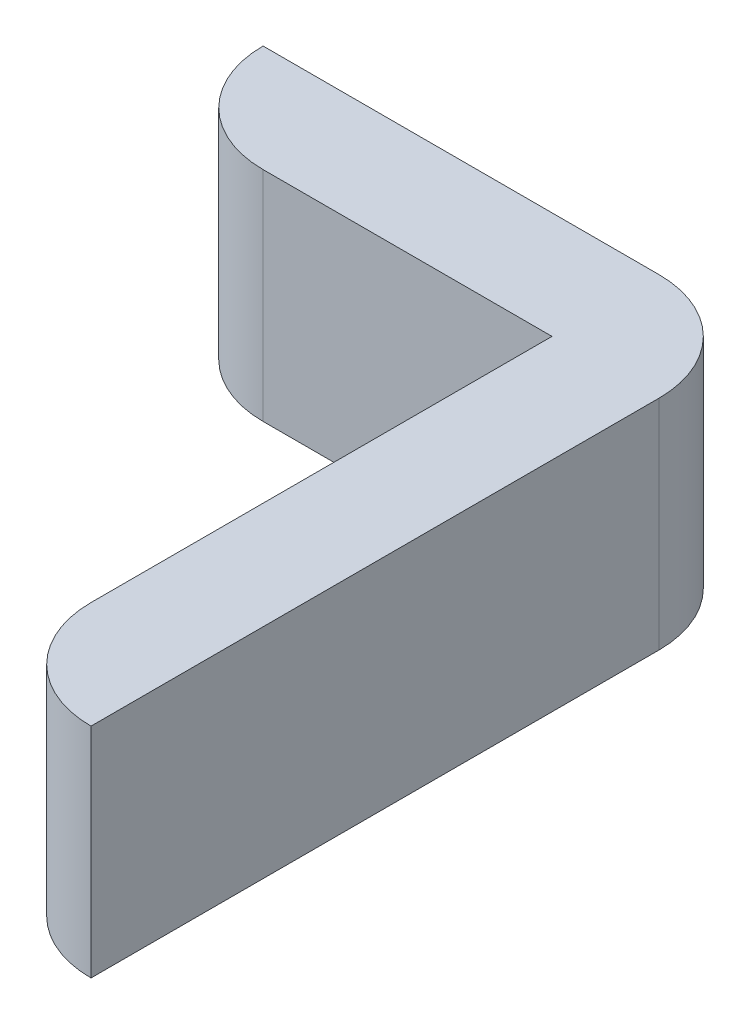
ISO-10303-21;
HEADER;
FILE_DESCRIPTION(('STEP AP214'),'2;1');
FILE_NAME('part.step','',(''),(''),'','','');
FILE_SCHEMA(('AUTOMOTIVE_DESIGN { 1 0 10303 214 1 1 1 1 }'));
ENDSEC;
DATA;
#1=APPLICATION_CONTEXT('core data for automotive mechanical design processes');
#2=APPLICATION_PROTOCOL_DEFINITION('international standard','automotive_design',2000,#1);
#3=PRODUCT_CONTEXT('',#1,'mechanical');
#4=PRODUCT('Part','Part','',(#3));
#5=PRODUCT_RELATED_PRODUCT_CATEGORY('part','',(#4));
#6=PRODUCT_DEFINITION_FORMATION('','',#4);
#7=PRODUCT_DEFINITION_CONTEXT('part definition',#1,'design');
#8=PRODUCT_DEFINITION('design','',#6,#7);
#9=PRODUCT_DEFINITION_SHAPE('','',#8);
#10=(LENGTH_UNIT() NAMED_UNIT(*) SI_UNIT(.MILLI.,.METRE.));
#11=(NAMED_UNIT(*) PLANE_ANGLE_UNIT() SI_UNIT($,.RADIAN.));
#12=(NAMED_UNIT(*) SI_UNIT($,.STERADIAN.) SOLID_ANGLE_UNIT());
#13=UNCERTAINTY_MEASURE_WITH_UNIT(LENGTH_MEASURE(1.E-05),#10,'distance_accuracy_value','');
#14=(GEOMETRIC_REPRESENTATION_CONTEXT(3) GLOBAL_UNCERTAINTY_ASSIGNED_CONTEXT((#13)) GLOBAL_UNIT_ASSIGNED_CONTEXT((#10,
#11,#12)) REPRESENTATION_CONTEXT('',''));
#15=CARTESIAN_POINT('',(0.,0.,0.));
#16=DIRECTION('',(0.,0.,1.));
#17=DIRECTION('',(1.,0.,0.));
#18=AXIS2_PLACEMENT_3D('',#15,#16,#17);
#19=CARTESIAN_POINT('',(9.275,-4.8252,0.));
#20=DIRECTION('',(0.,-1.,0.));
#21=DIRECTION('',(0.,0.,-1.));
#22=AXIS2_PLACEMENT_3D('',#19,#20,#21);
#23=PLANE('',#22);
#24=DIRECTION('',(-1.,0.,0.));
#25=VECTOR('',#24,1.);
#26=CARTESIAN_POINT('',(9.525,-4.8252,0.25));
#27=LINE('',#26,#25);
#28=CARTESIAN_POINT('',(9.525,-4.8252,0.25));
#29=VERTEX_POINT('',#28);
#30=CARTESIAN_POINT('',(10.2,-4.8252,0.25));
#31=VERTEX_POINT('',#30);
#32=EDGE_CURVE('E102',#29,#31,#27,.F.);
#33=ORIENTED_EDGE('',*,*,#32,.T.);
#34=DIRECTION('',(0.,0.,-1.));
#35=VECTOR('',#34,1.);
#36=CARTESIAN_POINT('',(10.2,-4.8252,0.25));
#37=LINE('',#36,#35);
#38=CARTESIAN_POINT('',(10.2,-4.8252,1.327));
#39=VERTEX_POINT('',#38);
#40=EDGE_CURVE('E108',#31,#39,#37,.F.);
#41=ORIENTED_EDGE('',*,*,#40,.T.);
#42=CARTESIAN_POINT('',(10.45,-4.8252,1.327));
#43=DIRECTION('',(0.,-1.,0.));
#44=DIRECTION('',(0.,0.,-1.));
#45=AXIS2_PLACEMENT_3D('',#42,#43,#44);
#46=CIRCLE('',#45,0.25);
#47=CARTESIAN_POINT('',(10.45,-4.8252,1.577));
#48=VERTEX_POINT('',#47);
#49=EDGE_CURVE('E80',#48,#39,#46,.T.);
#50=ORIENTED_EDGE('',*,*,#49,.F.);
#51=DIRECTION('',(0.,0.,1.));
#52=VECTOR('',#51,1.);
#53=CARTESIAN_POINT('',(10.45,-4.8252,1.577));
#54=LINE('',#53,#52);
#55=CARTESIAN_POINT('',(10.45,-4.8252,0.25));
#56=VERTEX_POINT('',#55);
#57=EDGE_CURVE('E75',#48,#56,#54,.F.);
#58=ORIENTED_EDGE('',*,*,#57,.T.);
#59=CARTESIAN_POINT('',(10.2,-4.8252,0.25));
#60=DIRECTION('',(0.,-1.,0.));
#61=DIRECTION('',(0.,0.,-1.));
#62=AXIS2_PLACEMENT_3D('',#59,#60,#61);
#63=CIRCLE('',#62,0.25);
#64=CARTESIAN_POINT('',(10.2,-4.8252,0.));
#65=VERTEX_POINT('',#64);
#66=EDGE_CURVE('E19',#65,#56,#63,.T.);
#67=ORIENTED_EDGE('',*,*,#66,.F.);
#68=DIRECTION('',(1.,0.,0.));
#69=VECTOR('',#68,1.);
#70=CARTESIAN_POINT('',(10.2,-4.8252,0.));
#71=LINE('',#70,#69);
#72=CARTESIAN_POINT('',(9.275,-4.8252,0.));
#73=VERTEX_POINT('',#72);
#74=EDGE_CURVE('E70',#65,#73,#71,.F.);
#75=ORIENTED_EDGE('',*,*,#74,.T.);
#76=CARTESIAN_POINT('',(9.525,-4.8252,0.));
#77=DIRECTION('',(0.,-1.,0.));
#78=DIRECTION('',(0.,0.,-1.));
#79=AXIS2_PLACEMENT_3D('',#76,#77,#78);
#80=CIRCLE('',#79,0.25);
#81=EDGE_CURVE('E121',#29,#73,#80,.T.);
#82=ORIENTED_EDGE('',*,*,#81,.F.);
#83=EDGE_LOOP('',(#33,#41,#50,#58,#67,#75,#82));
#84=FACE_BOUND('',#83,.T.);
#85=ADVANCED_FACE('F16',(#84),#23,.F.);
#86=CARTESIAN_POINT('',(10.2,-5.3348,0.));
#87=DIRECTION('',(0.,0.,1.));
#88=DIRECTION('',(1.,0.,0.));
#89=AXIS2_PLACEMENT_3D('',#86,#87,#88);
#90=PLANE('',#89);
#91=DIRECTION('',(0.,-1.,0.));
#92=VECTOR('',#91,1.);
#93=CARTESIAN_POINT('',(9.275,-5.3348,0.));
#94=LINE('',#93,#92);
#95=CARTESIAN_POINT('',(9.275,-5.3348,0.));
#96=VERTEX_POINT('',#95);
#97=EDGE_CURVE('E123',#73,#96,#94,.T.);
#98=ORIENTED_EDGE('',*,*,#97,.F.);
#99=ORIENTED_EDGE('',*,*,#74,.F.);
#100=DIRECTION('',(0.,-1.,0.));
#101=VECTOR('',#100,1.);
#102=CARTESIAN_POINT('',(10.2,-5.3348,0.));
#103=LINE('',#102,#101);
#104=CARTESIAN_POINT('',(10.2,-5.3348,0.));
#105=VERTEX_POINT('',#104);
#106=EDGE_CURVE('E92',#105,#65,#103,.F.);
#107=ORIENTED_EDGE('',*,*,#106,.F.);
#108=DIRECTION('',(1.,0.,0.));
#109=VECTOR('',#108,1.);
#110=CARTESIAN_POINT('',(9.275,-5.3348,0.));
#111=LINE('',#110,#109);
#112=EDGE_CURVE('E120',#96,#105,#111,.T.);
#113=ORIENTED_EDGE('',*,*,#112,.F.);
#114=EDGE_LOOP('',(#98,#99,#107,#113));
#115=FACE_BOUND('',#114,.T.);
#116=ADVANCED_FACE('F158',(#115),#90,.F.);
#117=CARTESIAN_POINT('',(10.2,-5.3348,0.25));
#118=DIRECTION('',(0.,-1.,0.));
#119=DIRECTION('',(0.,0.,-1.));
#120=AXIS2_PLACEMENT_3D('',#117,#118,#119);
#121=CYLINDRICAL_SURFACE('',#120,0.25);
#122=ORIENTED_EDGE('',*,*,#66,.T.);
#123=DIRECTION('',(0.,1.,0.));
#124=VECTOR('',#123,1.);
#125=CARTESIAN_POINT('',(10.45,-5.3348,0.25));
#126=LINE('',#125,#124);
#127=CARTESIAN_POINT('',(10.45,-5.3348,0.25));
#128=VERTEX_POINT('',#127);
#129=EDGE_CURVE('E86',#56,#128,#126,.F.);
#130=ORIENTED_EDGE('',*,*,#129,.T.);
#131=CARTESIAN_POINT('',(10.2,-5.3348,0.25));
#132=DIRECTION('',(0.,-1.,0.));
#133=DIRECTION('',(0.,0.,-1.));
#134=AXIS2_PLACEMENT_3D('',#131,#132,#133);
#135=CIRCLE('',#134,0.25);
#136=EDGE_CURVE('E118',#105,#128,#135,.T.);
#137=ORIENTED_EDGE('',*,*,#136,.F.);
#138=ORIENTED_EDGE('',*,*,#106,.T.);
#139=EDGE_LOOP('',(#122,#130,#137,#138));
#140=FACE_BOUND('',#139,.T.);
#141=ADVANCED_FACE('F89',(#140),#121,.T.);
#142=CARTESIAN_POINT('',(10.45,-5.3348,1.577));
#143=DIRECTION('',(-1.,0.,0.));
#144=DIRECTION('',(0.,0.,1.));
#145=AXIS2_PLACEMENT_3D('',#142,#143,#144);
#146=PLANE('',#145);
#147=DIRECTION('',(0.,-1.,0.));
#148=VECTOR('',#147,1.);
#149=CARTESIAN_POINT('',(10.45,-5.3348,1.577));
#150=LINE('',#149,#148);
#151=CARTESIAN_POINT('',(10.45,-5.3348,1.577));
#152=VERTEX_POINT('',#151);
#153=EDGE_CURVE('E85',#152,#48,#150,.F.);
#154=ORIENTED_EDGE('',*,*,#153,.F.);
#155=DIRECTION('',(0.,0.,-1.));
#156=VECTOR('',#155,1.);
#157=CARTESIAN_POINT('',(10.45,-5.3348,0.));
#158=LINE('',#157,#156);
#159=EDGE_CURVE('E94',#128,#152,#158,.F.);
#160=ORIENTED_EDGE('',*,*,#159,.F.);
#161=ORIENTED_EDGE('',*,*,#129,.F.);
#162=ORIENTED_EDGE('',*,*,#57,.F.);
#163=EDGE_LOOP('',(#154,#160,#161,#162));
#164=FACE_BOUND('',#163,.T.);
#165=ADVANCED_FACE('F93',(#164),#146,.F.);
#166=CARTESIAN_POINT('',(10.45,-5.3348,1.327));
#167=DIRECTION('',(0.,-1.,0.));
#168=DIRECTION('',(0.,0.,-1.));
#169=AXIS2_PLACEMENT_3D('',#166,#167,#168);
#170=CYLINDRICAL_SURFACE('',#169,0.25);
#171=ORIENTED_EDGE('',*,*,#49,.T.);
#172=DIRECTION('',(0.,1.,0.));
#173=VECTOR('',#172,1.);
#174=CARTESIAN_POINT('',(10.2,-5.3348,1.327));
#175=LINE('',#174,#173);
#176=CARTESIAN_POINT('',(10.2,-5.3348,1.327));
#177=VERTEX_POINT('',#176);
#178=EDGE_CURVE('E105',#39,#177,#175,.F.);
#179=ORIENTED_EDGE('',*,*,#178,.T.);
#180=CARTESIAN_POINT('',(10.45,-5.3348,1.327));
#181=DIRECTION('',(0.,-1.,0.));
#182=DIRECTION('',(0.,0.,-1.));
#183=AXIS2_PLACEMENT_3D('',#180,#181,#182);
#184=CIRCLE('',#183,0.25);
#185=EDGE_CURVE('E114',#152,#177,#184,.T.);
#186=ORIENTED_EDGE('',*,*,#185,.F.);
#187=ORIENTED_EDGE('',*,*,#153,.T.);
#188=EDGE_LOOP('',(#171,#179,#186,#187));
#189=FACE_BOUND('',#188,.T.);
#190=ADVANCED_FACE('F127',(#189),#170,.T.);
#191=CARTESIAN_POINT('',(10.2,-5.3348,0.25));
#192=DIRECTION('',(1.,0.,0.));
#193=DIRECTION('',(0.,0.,-1.));
#194=AXIS2_PLACEMENT_3D('',#191,#192,#193);
#195=PLANE('',#194);
#196=ORIENTED_EDGE('',*,*,#178,.F.);
#197=ORIENTED_EDGE('',*,*,#40,.F.);
#198=DIRECTION('',(0.,1.,0.));
#199=VECTOR('',#198,1.);
#200=CARTESIAN_POINT('',(10.2,-5.3348,0.25));
#201=LINE('',#200,#199);
#202=CARTESIAN_POINT('',(10.2,-5.3348,0.25));
#203=VERTEX_POINT('',#202);
#204=EDGE_CURVE('E104',#31,#203,#201,.F.);
#205=ORIENTED_EDGE('',*,*,#204,.T.);
#206=DIRECTION('',(0.,0.,-1.));
#207=VECTOR('',#206,1.);
#208=CARTESIAN_POINT('',(10.2,-5.3348,0.));
#209=LINE('',#208,#207);
#210=EDGE_CURVE('E117',#177,#203,#209,.T.);
#211=ORIENTED_EDGE('',*,*,#210,.F.);
#212=EDGE_LOOP('',(#196,#197,#205,#211));
#213=FACE_BOUND('',#212,.T.);
#214=ADVANCED_FACE('F150',(#213),#195,.F.);
#215=CARTESIAN_POINT('',(9.525,-5.3348,0.25));
#216=DIRECTION('',(0.,0.,-1.));
#217=DIRECTION('',(-1.,0.,0.));
#218=AXIS2_PLACEMENT_3D('',#215,#216,#217);
#219=PLANE('',#218);
#220=ORIENTED_EDGE('',*,*,#204,.F.);
#221=ORIENTED_EDGE('',*,*,#32,.F.);
#222=DIRECTION('',(0.,-1.,0.));
#223=VECTOR('',#222,1.);
#224=CARTESIAN_POINT('',(9.525,-5.3348,0.25));
#225=LINE('',#224,#223);
#226=CARTESIAN_POINT('',(9.525,-5.3348,0.25));
#227=VERTEX_POINT('',#226);
#228=EDGE_CURVE('E34',#227,#29,#225,.F.);
#229=ORIENTED_EDGE('',*,*,#228,.F.);
#230=DIRECTION('',(1.,0.,0.));
#231=VECTOR('',#230,1.);
#232=CARTESIAN_POINT('',(9.275,-5.3348,0.25));
#233=LINE('',#232,#231);
#234=EDGE_CURVE('E25',#203,#227,#233,.F.);
#235=ORIENTED_EDGE('',*,*,#234,.F.);
#236=EDGE_LOOP('',(#220,#221,#229,#235));
#237=FACE_BOUND('',#236,.T.);
#238=ADVANCED_FACE('F151',(#237),#219,.F.);
#239=CARTESIAN_POINT('',(9.525,-5.3348,0.));
#240=DIRECTION('',(0.,-1.,0.));
#241=DIRECTION('',(0.,0.,-1.));
#242=AXIS2_PLACEMENT_3D('',#239,#240,#241);
#243=CYLINDRICAL_SURFACE('',#242,0.25);
#244=ORIENTED_EDGE('',*,*,#81,.T.);
#245=ORIENTED_EDGE('',*,*,#97,.T.);
#246=CARTESIAN_POINT('',(9.525,-5.3348,0.));
#247=DIRECTION('',(0.,-1.,0.));
#248=DIRECTION('',(0.,0.,-1.));
#249=AXIS2_PLACEMENT_3D('',#246,#247,#248);
#250=CIRCLE('',#249,0.25);
#251=EDGE_CURVE('E11',#227,#96,#250,.T.);
#252=ORIENTED_EDGE('',*,*,#251,.F.);
#253=ORIENTED_EDGE('',*,*,#228,.T.);
#254=EDGE_LOOP('',(#244,#245,#252,#253));
#255=FACE_BOUND('',#254,.T.);
#256=ADVANCED_FACE('F156',(#255),#243,.T.);
#257=CARTESIAN_POINT('',(9.275,-5.3348,0.));
#258=DIRECTION('',(0.,-1.,0.));
#259=DIRECTION('',(0.,0.,-1.));
#260=AXIS2_PLACEMENT_3D('',#257,#258,#259);
#261=PLANE('',#260);
#262=ORIENTED_EDGE('',*,*,#234,.T.);
#263=ORIENTED_EDGE('',*,*,#251,.T.);
#264=ORIENTED_EDGE('',*,*,#112,.T.);
#265=ORIENTED_EDGE('',*,*,#136,.T.);
#266=ORIENTED_EDGE('',*,*,#159,.T.);
#267=ORIENTED_EDGE('',*,*,#185,.T.);
#268=ORIENTED_EDGE('',*,*,#210,.T.);
#269=EDGE_LOOP('',(#262,#263,#264,#265,#266,#267,#268));
#270=FACE_BOUND('',#269,.T.);
#271=ADVANCED_FACE('F132',(#270),#261,.T.);
#272=CLOSED_SHELL('',(#85,#116,#141,#165,#190,#214,#238,#256,#271));
#273=MANIFOLD_SOLID_BREP('B1',#272);
#274=ADVANCED_BREP_SHAPE_REPRESENTATION('',(#18,#273),#14);
#275=SHAPE_DEFINITION_REPRESENTATION(#9,#274);
ENDSEC;
END-ISO-10303-21;
